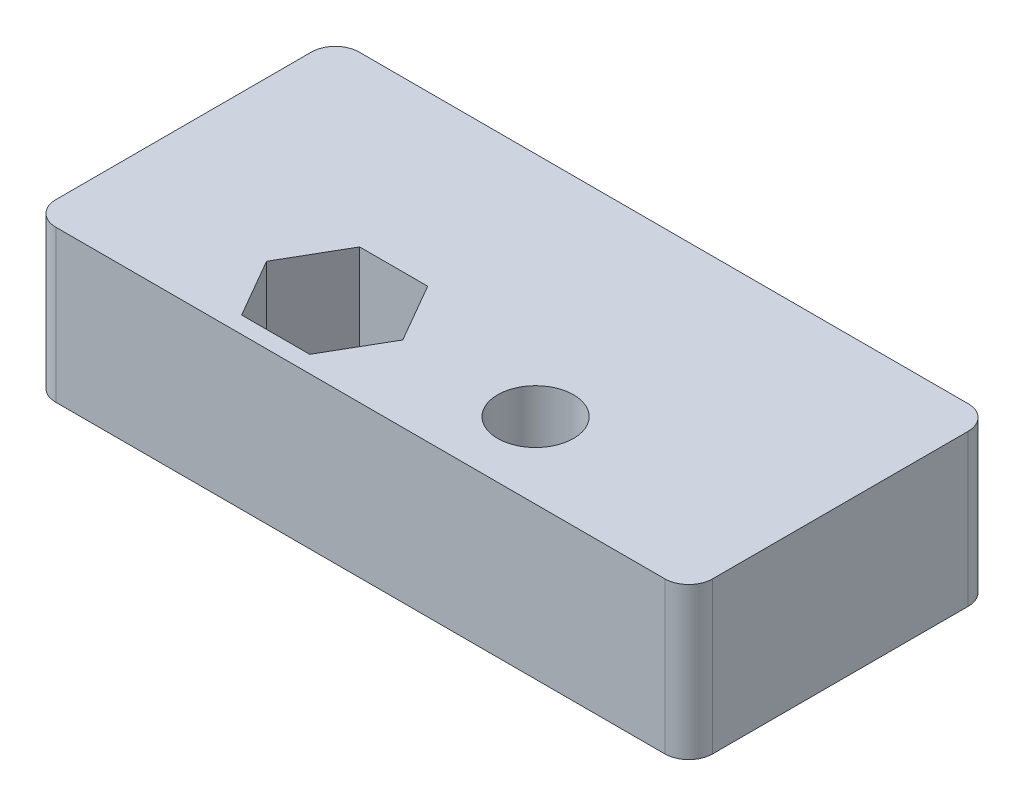
ISO-10303-21;
HEADER;
FILE_DESCRIPTION(('STEP AP214'),'2;1');
FILE_NAME('part.step','',(''),(''),'','','');
FILE_SCHEMA(('AUTOMOTIVE_DESIGN { 1 0 10303 214 1 1 1 1 }'));
ENDSEC;
DATA;
#1=APPLICATION_CONTEXT('core data for automotive mechanical design processes');
#2=APPLICATION_PROTOCOL_DEFINITION('international standard','automotive_design',2000,#1);
#3=PRODUCT_CONTEXT('',#1,'mechanical');
#4=PRODUCT('Part','Part','',(#3));
#5=PRODUCT_RELATED_PRODUCT_CATEGORY('part','',(#4));
#6=PRODUCT_DEFINITION_FORMATION('','',#4);
#7=PRODUCT_DEFINITION_CONTEXT('part definition',#1,'design');
#8=PRODUCT_DEFINITION('design','',#6,#7);
#9=PRODUCT_DEFINITION_SHAPE('','',#8);
#10=(LENGTH_UNIT() NAMED_UNIT(*) SI_UNIT(.MILLI.,.METRE.));
#11=(NAMED_UNIT(*) PLANE_ANGLE_UNIT() SI_UNIT($,.RADIAN.));
#12=(NAMED_UNIT(*) SI_UNIT($,.STERADIAN.) SOLID_ANGLE_UNIT());
#13=UNCERTAINTY_MEASURE_WITH_UNIT(LENGTH_MEASURE(1.E-05),#10,'distance_accuracy_value','');
#14=(GEOMETRIC_REPRESENTATION_CONTEXT(3) GLOBAL_UNCERTAINTY_ASSIGNED_CONTEXT((#13)) GLOBAL_UNIT_ASSIGNED_CONTEXT((#10,
#11,#12)) REPRESENTATION_CONTEXT('',''));
#15=CARTESIAN_POINT('',(0.,0.,0.));
#16=DIRECTION('',(0.,0.,1.));
#17=DIRECTION('',(1.,0.,0.));
#18=AXIS2_PLACEMENT_3D('',#15,#16,#17);
#19=CARTESIAN_POINT('',(0.,6.35,0.));
#20=DIRECTION('',(0.,-1.,0.));
#21=DIRECTION('',(0.,0.,-1.));
#22=AXIS2_PLACEMENT_3D('',#19,#20,#21);
#23=PLANE('',#22);
#24=CARTESIAN_POINT('',(17.9125,6.35,-3.175));
#25=DIRECTION('',(0.,1.,0.));
#26=DIRECTION('',(0.,0.,1.));
#27=AXIS2_PLACEMENT_3D('',#24,#25,#26);
#28=CIRCLE('',#27,1.5875);
#29=CARTESIAN_POINT('',(17.9125,6.35,-1.5875));
#30=VERTEX_POINT('',#29);
#31=EDGE_CURVE('E191',#30,#30,#28,.T.);
#32=ORIENTED_EDGE('',*,*,#31,.F.);
#33=EDGE_LOOP('',(#32));
#34=FACE_BOUND('',#33,.T.);
#35=DIRECTION('',(0.,0.,1.));
#36=VECTOR('',#35,1.);
#37=CARTESIAN_POINT('',(0.,6.35,0.));
#38=LINE('',#37,#36);
#39=CARTESIAN_POINT('',(0.,6.35,-11.7));
#40=VERTEX_POINT('',#39);
#41=CARTESIAN_POINT('',(0.,6.35,-1.));
#42=VERTEX_POINT('',#41);
#43=EDGE_CURVE('E197',#40,#42,#38,.T.);
#44=ORIENTED_EDGE('',*,*,#43,.T.);
#45=CARTESIAN_POINT('',(1.,6.35,-1.));
#46=DIRECTION('',(0.,-1.,0.));
#47=DIRECTION('',(0.,0.,-1.));
#48=AXIS2_PLACEMENT_3D('',#45,#46,#47);
#49=CIRCLE('',#48,1.);
#50=CARTESIAN_POINT('',(1.,6.35,0.));
#51=VERTEX_POINT('',#50);
#52=EDGE_CURVE('E240',#42,#51,#49,.F.);
#53=ORIENTED_EDGE('',*,*,#52,.T.);
#54=DIRECTION('',(1.,0.,0.));
#55=VECTOR('',#54,1.);
#56=CARTESIAN_POINT('',(0.,6.35,0.));
#57=LINE('',#56,#55);
#58=CARTESIAN_POINT('',(26.5,6.35,0.));
#59=VERTEX_POINT('',#58);
#60=EDGE_CURVE('E200',#51,#59,#57,.T.);
#61=ORIENTED_EDGE('',*,*,#60,.T.);
#62=CARTESIAN_POINT('',(26.5,6.35,-1.));
#63=DIRECTION('',(0.,-1.,0.));
#64=DIRECTION('',(0.,0.,-1.));
#65=AXIS2_PLACEMENT_3D('',#62,#63,#64);
#66=CIRCLE('',#65,1.);
#67=CARTESIAN_POINT('',(27.5,6.35,-1.));
#68=VERTEX_POINT('',#67);
#69=EDGE_CURVE('E235',#59,#68,#66,.F.);
#70=ORIENTED_EDGE('',*,*,#69,.T.);
#71=DIRECTION('',(0.,0.,-1.));
#72=VECTOR('',#71,1.);
#73=CARTESIAN_POINT('',(27.5,6.35,0.));
#74=LINE('',#73,#72);
#75=CARTESIAN_POINT('',(27.5,6.35,-11.7));
#76=VERTEX_POINT('',#75);
#77=EDGE_CURVE('E204',#68,#76,#74,.T.);
#78=ORIENTED_EDGE('',*,*,#77,.T.);
#79=CARTESIAN_POINT('',(26.5,6.35,-11.7));
#80=DIRECTION('',(0.,-1.,0.));
#81=DIRECTION('',(0.,0.,-1.));
#82=AXIS2_PLACEMENT_3D('',#79,#80,#81);
#83=CIRCLE('',#82,1.);
#84=CARTESIAN_POINT('',(26.5,6.35,-12.7));
#85=VERTEX_POINT('',#84);
#86=EDGE_CURVE('E54',#76,#85,#83,.F.);
#87=ORIENTED_EDGE('',*,*,#86,.T.);
#88=DIRECTION('',(-1.,0.,0.));
#89=VECTOR('',#88,1.);
#90=CARTESIAN_POINT('',(0.,6.35,-12.7));
#91=LINE('',#90,#89);
#92=CARTESIAN_POINT('',(1.,6.35,-12.7));
#93=VERTEX_POINT('',#92);
#94=EDGE_CURVE('E206',#85,#93,#91,.T.);
#95=ORIENTED_EDGE('',*,*,#94,.T.);
#96=CARTESIAN_POINT('',(1.,6.35,-11.7));
#97=DIRECTION('',(0.,-1.,0.));
#98=DIRECTION('',(0.,0.,-1.));
#99=AXIS2_PLACEMENT_3D('',#96,#97,#98);
#100=CIRCLE('',#99,1.);
#101=EDGE_CURVE('E238',#93,#40,#100,.F.);
#102=ORIENTED_EDGE('',*,*,#101,.T.);
#103=EDGE_LOOP('',(#44,#53,#61,#70,#78,#87,#95,#102));
#104=FACE_BOUND('',#103,.T.);
#105=DIRECTION('',(0.5,0.,-0.866025403784439));
#106=VECTOR('',#105,1.);
#107=CARTESIAN_POINT('',(10.9261417674388,6.35,-0.704849999999999));
#108=LINE('',#107,#106);
#109=CARTESIAN_POINT('',(10.9261417674388,6.35,-0.704849999999999));
#110=VERTEX_POINT('',#109);
#111=CARTESIAN_POINT('',(12.3522835348775,6.35,-3.175));
#112=VERTEX_POINT('',#111);
#113=EDGE_CURVE('E135',#110,#112,#108,.T.);
#114=ORIENTED_EDGE('',*,*,#113,.F.);
#115=DIRECTION('',(1.,0.,0.));
#116=VECTOR('',#115,1.);
#117=CARTESIAN_POINT('',(8.07385823256124,6.35,-0.70485));
#118=LINE('',#117,#116);
#119=CARTESIAN_POINT('',(8.07385823256124,6.35,-0.70485));
#120=VERTEX_POINT('',#119);
#121=EDGE_CURVE('E167',#120,#110,#118,.T.);
#122=ORIENTED_EDGE('',*,*,#121,.F.);
#123=DIRECTION('',(0.5,0.,0.866025403784439));
#124=VECTOR('',#123,1.);
#125=CARTESIAN_POINT('',(6.64771646512249,6.35,-3.175));
#126=LINE('',#125,#124);
#127=CARTESIAN_POINT('',(6.64771646512249,6.35,-3.175));
#128=VERTEX_POINT('',#127);
#129=EDGE_CURVE('E164',#128,#120,#126,.T.);
#130=ORIENTED_EDGE('',*,*,#129,.F.);
#131=DIRECTION('',(-0.5,0.,0.866025403784439));
#132=VECTOR('',#131,1.);
#133=CARTESIAN_POINT('',(8.07385823256125,6.35,-5.64515));
#134=LINE('',#133,#132);
#135=CARTESIAN_POINT('',(8.07385823256125,6.35,-5.64515));
#136=VERTEX_POINT('',#135);
#137=EDGE_CURVE('E160',#136,#128,#134,.T.);
#138=ORIENTED_EDGE('',*,*,#137,.F.);
#139=DIRECTION('',(-1.,0.,0.));
#140=VECTOR('',#139,1.);
#141=CARTESIAN_POINT('',(10.9261417674388,6.35,-5.64515));
#142=LINE('',#141,#140);
#143=CARTESIAN_POINT('',(10.9261417674388,6.35,-5.64515));
#144=VERTEX_POINT('',#143);
#145=EDGE_CURVE('E158',#144,#136,#142,.T.);
#146=ORIENTED_EDGE('',*,*,#145,.F.);
#147=DIRECTION('',(-0.5,0.,-0.866025403784439));
#148=VECTOR('',#147,1.);
#149=CARTESIAN_POINT('',(12.3522835348775,6.35,-3.175));
#150=LINE('',#149,#148);
#151=EDGE_CURVE('E145',#112,#144,#150,.T.);
#152=ORIENTED_EDGE('',*,*,#151,.F.);
#153=EDGE_LOOP('',(#114,#122,#130,#138,#146,#152));
#154=FACE_BOUND('',#153,.T.);
#155=ADVANCED_FACE('F32',(#34,#104,#154),#23,.F.);
#156=CARTESIAN_POINT('',(0.,0.,0.));
#157=DIRECTION('',(0.,-1.,0.));
#158=DIRECTION('',(0.,0.,-1.));
#159=AXIS2_PLACEMENT_3D('',#156,#157,#158);
#160=PLANE('',#159);
#161=DIRECTION('',(1.,0.,0.));
#162=VECTOR('',#161,1.);
#163=CARTESIAN_POINT('',(0.,0.,0.));
#164=LINE('',#163,#162);
#165=CARTESIAN_POINT('',(1.,0.,0.));
#166=VERTEX_POINT('',#165);
#167=CARTESIAN_POINT('',(26.5,0.,0.));
#168=VERTEX_POINT('',#167);
#169=EDGE_CURVE('E211',#166,#168,#164,.T.);
#170=ORIENTED_EDGE('',*,*,#169,.F.);
#171=CARTESIAN_POINT('',(1.,0.,-1.));
#172=DIRECTION('',(0.,-1.,0.));
#173=DIRECTION('',(0.,0.,-1.));
#174=AXIS2_PLACEMENT_3D('',#171,#172,#173);
#175=CIRCLE('',#174,1.);
#176=CARTESIAN_POINT('',(0.,0.,-1.));
#177=VERTEX_POINT('',#176);
#178=EDGE_CURVE('E228',#166,#177,#175,.T.);
#179=ORIENTED_EDGE('',*,*,#178,.T.);
#180=DIRECTION('',(0.,0.,1.));
#181=VECTOR('',#180,1.);
#182=CARTESIAN_POINT('',(0.,0.,0.));
#183=LINE('',#182,#181);
#184=CARTESIAN_POINT('',(0.,0.,-11.7));
#185=VERTEX_POINT('',#184);
#186=EDGE_CURVE('E194',#185,#177,#183,.T.);
#187=ORIENTED_EDGE('',*,*,#186,.F.);
#188=CARTESIAN_POINT('',(1.,0.,-11.7));
#189=DIRECTION('',(0.,-1.,0.));
#190=DIRECTION('',(0.,0.,-1.));
#191=AXIS2_PLACEMENT_3D('',#188,#189,#190);
#192=CIRCLE('',#191,1.);
#193=CARTESIAN_POINT('',(1.,0.,-12.7));
#194=VERTEX_POINT('',#193);
#195=EDGE_CURVE('E226',#185,#194,#192,.T.);
#196=ORIENTED_EDGE('',*,*,#195,.T.);
#197=DIRECTION('',(-1.,0.,0.));
#198=VECTOR('',#197,1.);
#199=CARTESIAN_POINT('',(0.,0.,-12.7));
#200=LINE('',#199,#198);
#201=CARTESIAN_POINT('',(26.5,0.,-12.7));
#202=VERTEX_POINT('',#201);
#203=EDGE_CURVE('E201',#202,#194,#200,.T.);
#204=ORIENTED_EDGE('',*,*,#203,.F.);
#205=CARTESIAN_POINT('',(26.5,0.,-11.7));
#206=DIRECTION('',(0.,-1.,0.));
#207=DIRECTION('',(0.,0.,-1.));
#208=AXIS2_PLACEMENT_3D('',#205,#206,#207);
#209=CIRCLE('',#208,1.);
#210=CARTESIAN_POINT('',(27.5,0.,-11.7));
#211=VERTEX_POINT('',#210);
#212=EDGE_CURVE('E224',#202,#211,#209,.T.);
#213=ORIENTED_EDGE('',*,*,#212,.T.);
#214=DIRECTION('',(0.,0.,-1.));
#215=VECTOR('',#214,1.);
#216=CARTESIAN_POINT('',(27.5,0.,0.));
#217=LINE('',#216,#215);
#218=CARTESIAN_POINT('',(27.5,0.,-1.));
#219=VERTEX_POINT('',#218);
#220=EDGE_CURVE('E214',#219,#211,#217,.T.);
#221=ORIENTED_EDGE('',*,*,#220,.F.);
#222=CARTESIAN_POINT('',(26.5,0.,-1.));
#223=DIRECTION('',(0.,-1.,0.));
#224=DIRECTION('',(0.,0.,-1.));
#225=AXIS2_PLACEMENT_3D('',#222,#223,#224);
#226=CIRCLE('',#225,1.);
#227=EDGE_CURVE('E222',#219,#168,#226,.T.);
#228=ORIENTED_EDGE('',*,*,#227,.T.);
#229=EDGE_LOOP('',(#170,#179,#187,#196,#204,#213,#221,#228));
#230=FACE_BOUND('',#229,.T.);
#231=CARTESIAN_POINT('',(17.9125,0.,-3.175));
#232=DIRECTION('',(0.,1.,0.));
#233=DIRECTION('',(0.,0.,1.));
#234=AXIS2_PLACEMENT_3D('',#231,#232,#233);
#235=CIRCLE('',#234,1.5875);
#236=CARTESIAN_POINT('',(17.9125,0.,-1.5875));
#237=VERTEX_POINT('',#236);
#238=EDGE_CURVE('E153',#237,#237,#235,.T.);
#239=ORIENTED_EDGE('',*,*,#238,.T.);
#240=EDGE_LOOP('',(#239));
#241=FACE_BOUND('',#240,.T.);
#242=DIRECTION('',(1.,0.,0.));
#243=VECTOR('',#242,1.);
#244=CARTESIAN_POINT('',(8.07385823256124,0.,-0.70485));
#245=LINE('',#244,#243);
#246=CARTESIAN_POINT('',(8.07385823256124,0.,-0.70485));
#247=VERTEX_POINT('',#246);
#248=CARTESIAN_POINT('',(10.9261417674388,0.,-0.704849999999999));
#249=VERTEX_POINT('',#248);
#250=EDGE_CURVE('E146',#247,#249,#245,.T.);
#251=ORIENTED_EDGE('',*,*,#250,.T.);
#252=DIRECTION('',(0.5,0.,-0.866025403784439));
#253=VECTOR('',#252,1.);
#254=CARTESIAN_POINT('',(10.9261417674388,0.,-0.704849999999999));
#255=LINE('',#254,#253);
#256=CARTESIAN_POINT('',(12.3522835348775,0.,-3.175));
#257=VERTEX_POINT('',#256);
#258=EDGE_CURVE('E169',#249,#257,#255,.T.);
#259=ORIENTED_EDGE('',*,*,#258,.T.);
#260=DIRECTION('',(-0.5,0.,-0.866025403784439));
#261=VECTOR('',#260,1.);
#262=CARTESIAN_POINT('',(12.3522835348775,0.,-3.175));
#263=LINE('',#262,#261);
#264=CARTESIAN_POINT('',(10.9261417674388,0.,-5.64515));
#265=VERTEX_POINT('',#264);
#266=EDGE_CURVE('E152',#257,#265,#263,.T.);
#267=ORIENTED_EDGE('',*,*,#266,.T.);
#268=DIRECTION('',(-1.,0.,0.));
#269=VECTOR('',#268,1.);
#270=CARTESIAN_POINT('',(10.9261417674388,0.,-5.64515));
#271=LINE('',#270,#269);
#272=CARTESIAN_POINT('',(8.07385823256125,0.,-5.64515));
#273=VERTEX_POINT('',#272);
#274=EDGE_CURVE('E172',#265,#273,#271,.T.);
#275=ORIENTED_EDGE('',*,*,#274,.T.);
#276=DIRECTION('',(-0.5,0.,0.866025403784439));
#277=VECTOR('',#276,1.);
#278=CARTESIAN_POINT('',(8.07385823256125,0.,-5.64515));
#279=LINE('',#278,#277);
#280=CARTESIAN_POINT('',(6.64771646512249,0.,-3.175));
#281=VERTEX_POINT('',#280);
#282=EDGE_CURVE('E175',#273,#281,#279,.T.);
#283=ORIENTED_EDGE('',*,*,#282,.T.);
#284=DIRECTION('',(0.5,0.,0.866025403784439));
#285=VECTOR('',#284,1.);
#286=CARTESIAN_POINT('',(6.64771646512249,0.,-3.175));
#287=LINE('',#286,#285);
#288=EDGE_CURVE('E178',#281,#247,#287,.T.);
#289=ORIENTED_EDGE('',*,*,#288,.T.);
#290=EDGE_LOOP('',(#251,#259,#267,#275,#283,#289));
#291=FACE_BOUND('',#290,.T.);
#292=ADVANCED_FACE('F256',(#230,#241,#291),#160,.T.);
#293=CARTESIAN_POINT('',(0.,6.35,0.));
#294=DIRECTION('',(1.,0.,0.));
#295=DIRECTION('',(0.,0.,-1.));
#296=AXIS2_PLACEMENT_3D('',#293,#294,#295);
#297=PLANE('',#296);
#298=ORIENTED_EDGE('',*,*,#186,.T.);
#299=DIRECTION('',(0.,-1.,0.));
#300=VECTOR('',#299,1.);
#301=CARTESIAN_POINT('',(0.,6.35,-1.));
#302=LINE('',#301,#300);
#303=EDGE_CURVE('E233',#177,#42,#302,.F.);
#304=ORIENTED_EDGE('',*,*,#303,.T.);
#305=ORIENTED_EDGE('',*,*,#43,.F.);
#306=DIRECTION('',(0.,-1.,0.));
#307=VECTOR('',#306,1.);
#308=CARTESIAN_POINT('',(0.,6.35,-11.7));
#309=LINE('',#308,#307);
#310=EDGE_CURVE('E230',#40,#185,#309,.T.);
#311=ORIENTED_EDGE('',*,*,#310,.T.);
#312=EDGE_LOOP('',(#298,#304,#305,#311));
#313=FACE_BOUND('',#312,.T.);
#314=ADVANCED_FACE('F270',(#313),#297,.F.);
#315=CARTESIAN_POINT('',(0.,6.35,0.));
#316=DIRECTION('',(0.,0.,-1.));
#317=DIRECTION('',(-1.,0.,0.));
#318=AXIS2_PLACEMENT_3D('',#315,#316,#317);
#319=PLANE('',#318);
#320=ORIENTED_EDGE('',*,*,#60,.F.);
#321=DIRECTION('',(0.,-1.,0.));
#322=VECTOR('',#321,1.);
#323=CARTESIAN_POINT('',(1.,6.35,0.));
#324=LINE('',#323,#322);
#325=EDGE_CURVE('E219',#51,#166,#324,.T.);
#326=ORIENTED_EDGE('',*,*,#325,.T.);
#327=ORIENTED_EDGE('',*,*,#169,.T.);
#328=DIRECTION('',(0.,-1.,0.));
#329=VECTOR('',#328,1.);
#330=CARTESIAN_POINT('',(26.5,6.35,0.));
#331=LINE('',#330,#329);
#332=EDGE_CURVE('E208',#168,#59,#331,.F.);
#333=ORIENTED_EDGE('',*,*,#332,.T.);
#334=EDGE_LOOP('',(#320,#326,#327,#333));
#335=FACE_BOUND('',#334,.T.);
#336=ADVANCED_FACE('F278',(#335),#319,.F.);
#337=CARTESIAN_POINT('',(27.5,6.35,0.));
#338=DIRECTION('',(-1.,0.,0.));
#339=DIRECTION('',(0.,0.,1.));
#340=AXIS2_PLACEMENT_3D('',#337,#338,#339);
#341=PLANE('',#340);
#342=ORIENTED_EDGE('',*,*,#220,.T.);
#343=DIRECTION('',(0.,-1.,0.));
#344=VECTOR('',#343,1.);
#345=CARTESIAN_POINT('',(27.5,6.35,-11.7));
#346=LINE('',#345,#344);
#347=EDGE_CURVE('E11',#211,#76,#346,.F.);
#348=ORIENTED_EDGE('',*,*,#347,.T.);
#349=ORIENTED_EDGE('',*,*,#77,.F.);
#350=DIRECTION('',(0.,-1.,0.));
#351=VECTOR('',#350,1.);
#352=CARTESIAN_POINT('',(27.5,6.35,-1.));
#353=LINE('',#352,#351);
#354=EDGE_CURVE('E40',#68,#219,#353,.T.);
#355=ORIENTED_EDGE('',*,*,#354,.T.);
#356=EDGE_LOOP('',(#342,#348,#349,#355));
#357=FACE_BOUND('',#356,.T.);
#358=ADVANCED_FACE('F250',(#357),#341,.F.);
#359=CARTESIAN_POINT('',(0.,6.35,-12.7));
#360=DIRECTION('',(0.,0.,1.));
#361=DIRECTION('',(1.,0.,0.));
#362=AXIS2_PLACEMENT_3D('',#359,#360,#361);
#363=PLANE('',#362);
#364=ORIENTED_EDGE('',*,*,#203,.T.);
#365=DIRECTION('',(0.,-1.,0.));
#366=VECTOR('',#365,1.);
#367=CARTESIAN_POINT('',(1.,6.35,-12.7));
#368=LINE('',#367,#366);
#369=EDGE_CURVE('E47',#194,#93,#368,.F.);
#370=ORIENTED_EDGE('',*,*,#369,.T.);
#371=ORIENTED_EDGE('',*,*,#94,.F.);
#372=DIRECTION('',(0.,-1.,0.));
#373=VECTOR('',#372,1.);
#374=CARTESIAN_POINT('',(26.5,6.35,-12.7));
#375=LINE('',#374,#373);
#376=EDGE_CURVE('E242',#85,#202,#375,.T.);
#377=ORIENTED_EDGE('',*,*,#376,.T.);
#378=EDGE_LOOP('',(#364,#370,#371,#377));
#379=FACE_BOUND('',#378,.T.);
#380=ADVANCED_FACE('F262',(#379),#363,.F.);
#381=CARTESIAN_POINT('',(17.9125,6.35,-3.175));
#382=DIRECTION('',(0.,-1.,0.));
#383=DIRECTION('',(0.,0.,-1.));
#384=AXIS2_PLACEMENT_3D('',#381,#382,#383);
#385=CYLINDRICAL_SURFACE('',#384,1.5875);
#386=ORIENTED_EDGE('',*,*,#31,.T.);
#387=EDGE_LOOP('',(#386));
#388=FACE_BOUND('',#387,.T.);
#389=ORIENTED_EDGE('',*,*,#238,.F.);
#390=EDGE_LOOP('',(#389));
#391=FACE_BOUND('',#390,.T.);
#392=ADVANCED_FACE('F293',(#388,#391),#385,.F.);
#393=CARTESIAN_POINT('',(10.9261417674388,6.35,-0.704849999999999));
#394=DIRECTION('',(-0.866025403784438,0.,-0.5));
#395=DIRECTION('',(-0.5,0.,0.866025403784439));
#396=AXIS2_PLACEMENT_3D('',#393,#394,#395);
#397=PLANE('',#396);
#398=ORIENTED_EDGE('',*,*,#258,.F.);
#399=DIRECTION('',(0.,-1.,0.));
#400=VECTOR('',#399,1.);
#401=CARTESIAN_POINT('',(10.9261417674388,6.35,-0.704849999999999));
#402=LINE('',#401,#400);
#403=EDGE_CURVE('E141',#110,#249,#402,.T.);
#404=ORIENTED_EDGE('',*,*,#403,.F.);
#405=ORIENTED_EDGE('',*,*,#113,.T.);
#406=DIRECTION('',(0.,-1.,0.));
#407=VECTOR('',#406,1.);
#408=CARTESIAN_POINT('',(12.3522835348775,6.35,-3.175));
#409=LINE('',#408,#407);
#410=EDGE_CURVE('E138',#112,#257,#409,.T.);
#411=ORIENTED_EDGE('',*,*,#410,.T.);
#412=EDGE_LOOP('',(#398,#404,#405,#411));
#413=FACE_BOUND('',#412,.T.);
#414=ADVANCED_FACE('F137',(#413),#397,.T.);
#415=CARTESIAN_POINT('',(12.3522835348775,6.35,-3.175));
#416=DIRECTION('',(-0.866025403784439,0.,0.5));
#417=DIRECTION('',(0.5,0.,0.866025403784439));
#418=AXIS2_PLACEMENT_3D('',#415,#416,#417);
#419=PLANE('',#418);
#420=ORIENTED_EDGE('',*,*,#266,.F.);
#421=ORIENTED_EDGE('',*,*,#410,.F.);
#422=ORIENTED_EDGE('',*,*,#151,.T.);
#423=DIRECTION('',(0.,-1.,0.));
#424=VECTOR('',#423,1.);
#425=CARTESIAN_POINT('',(10.9261417674388,6.35,-5.64515));
#426=LINE('',#425,#424);
#427=EDGE_CURVE('E154',#144,#265,#426,.T.);
#428=ORIENTED_EDGE('',*,*,#427,.T.);
#429=EDGE_LOOP('',(#420,#421,#422,#428));
#430=FACE_BOUND('',#429,.T.);
#431=ADVANCED_FACE('F149',(#430),#419,.T.);
#432=CARTESIAN_POINT('',(10.9261417674388,6.35,-5.64515));
#433=DIRECTION('',(0.,0.,1.));
#434=DIRECTION('',(1.,0.,0.));
#435=AXIS2_PLACEMENT_3D('',#432,#433,#434);
#436=PLANE('',#435);
#437=ORIENTED_EDGE('',*,*,#274,.F.);
#438=ORIENTED_EDGE('',*,*,#427,.F.);
#439=ORIENTED_EDGE('',*,*,#145,.T.);
#440=DIRECTION('',(0.,-1.,0.));
#441=VECTOR('',#440,1.);
#442=CARTESIAN_POINT('',(8.07385823256125,6.35,-5.64515));
#443=LINE('',#442,#441);
#444=EDGE_CURVE('E188',#136,#273,#443,.T.);
#445=ORIENTED_EDGE('',*,*,#444,.T.);
#446=EDGE_LOOP('',(#437,#438,#439,#445));
#447=FACE_BOUND('',#446,.T.);
#448=ADVANCED_FACE('F355',(#447),#436,.T.);
#449=CARTESIAN_POINT('',(8.07385823256125,6.35,-5.64515));
#450=DIRECTION('',(0.866025403784439,0.,0.5));
#451=DIRECTION('',(0.5,0.,-0.866025403784439));
#452=AXIS2_PLACEMENT_3D('',#449,#450,#451);
#453=PLANE('',#452);
#454=ORIENTED_EDGE('',*,*,#282,.F.);
#455=ORIENTED_EDGE('',*,*,#444,.F.);
#456=ORIENTED_EDGE('',*,*,#137,.T.);
#457=DIRECTION('',(0.,-1.,0.));
#458=VECTOR('',#457,1.);
#459=CARTESIAN_POINT('',(6.64771646512249,6.35,-3.175));
#460=LINE('',#459,#458);
#461=EDGE_CURVE('E186',#128,#281,#460,.T.);
#462=ORIENTED_EDGE('',*,*,#461,.T.);
#463=EDGE_LOOP('',(#454,#455,#456,#462));
#464=FACE_BOUND('',#463,.T.);
#465=ADVANCED_FACE('F346',(#464),#453,.T.);
#466=CARTESIAN_POINT('',(6.64771646512249,6.35,-3.175));
#467=DIRECTION('',(0.866025403784439,0.,-0.5));
#468=DIRECTION('',(-0.5,0.,-0.866025403784439));
#469=AXIS2_PLACEMENT_3D('',#466,#467,#468);
#470=PLANE('',#469);
#471=ORIENTED_EDGE('',*,*,#288,.F.);
#472=ORIENTED_EDGE('',*,*,#461,.F.);
#473=ORIENTED_EDGE('',*,*,#129,.T.);
#474=DIRECTION('',(0.,-1.,0.));
#475=VECTOR('',#474,1.);
#476=CARTESIAN_POINT('',(8.07385823256124,6.35,-0.70485));
#477=LINE('',#476,#475);
#478=EDGE_CURVE('E184',#120,#247,#477,.T.);
#479=ORIENTED_EDGE('',*,*,#478,.T.);
#480=EDGE_LOOP('',(#471,#472,#473,#479));
#481=FACE_BOUND('',#480,.T.);
#482=ADVANCED_FACE('F337',(#481),#470,.T.);
#483=CARTESIAN_POINT('',(8.07385823256124,6.35,-0.70485));
#484=DIRECTION('',(0.,0.,-1.));
#485=DIRECTION('',(-1.,0.,0.));
#486=AXIS2_PLACEMENT_3D('',#483,#484,#485);
#487=PLANE('',#486);
#488=ORIENTED_EDGE('',*,*,#250,.F.);
#489=ORIENTED_EDGE('',*,*,#478,.F.);
#490=ORIENTED_EDGE('',*,*,#121,.T.);
#491=ORIENTED_EDGE('',*,*,#403,.T.);
#492=EDGE_LOOP('',(#488,#489,#490,#491));
#493=FACE_BOUND('',#492,.T.);
#494=ADVANCED_FACE('F306',(#493),#487,.T.);
#495=CARTESIAN_POINT('',(1.,6.35,-1.));
#496=DIRECTION('',(0.,-1.,0.));
#497=DIRECTION('',(0.,0.,-1.));
#498=AXIS2_PLACEMENT_3D('',#495,#496,#497);
#499=CYLINDRICAL_SURFACE('',#498,1.);
#500=ORIENTED_EDGE('',*,*,#52,.F.);
#501=ORIENTED_EDGE('',*,*,#303,.F.);
#502=ORIENTED_EDGE('',*,*,#178,.F.);
#503=ORIENTED_EDGE('',*,*,#325,.F.);
#504=EDGE_LOOP('',(#500,#501,#502,#503));
#505=FACE_BOUND('',#504,.T.);
#506=ADVANCED_FACE('F275',(#505),#499,.T.);
#507=CARTESIAN_POINT('',(1.,6.35,-11.7));
#508=DIRECTION('',(0.,-1.,0.));
#509=DIRECTION('',(0.,0.,-1.));
#510=AXIS2_PLACEMENT_3D('',#507,#508,#509);
#511=CYLINDRICAL_SURFACE('',#510,1.);
#512=ORIENTED_EDGE('',*,*,#101,.F.);
#513=ORIENTED_EDGE('',*,*,#369,.F.);
#514=ORIENTED_EDGE('',*,*,#195,.F.);
#515=ORIENTED_EDGE('',*,*,#310,.F.);
#516=EDGE_LOOP('',(#512,#513,#514,#515));
#517=FACE_BOUND('',#516,.T.);
#518=ADVANCED_FACE('F267',(#517),#511,.T.);
#519=CARTESIAN_POINT('',(26.5,6.35,-11.7));
#520=DIRECTION('',(0.,-1.,0.));
#521=DIRECTION('',(0.,0.,-1.));
#522=AXIS2_PLACEMENT_3D('',#519,#520,#521);
#523=CYLINDRICAL_SURFACE('',#522,1.);
#524=ORIENTED_EDGE('',*,*,#86,.F.);
#525=ORIENTED_EDGE('',*,*,#347,.F.);
#526=ORIENTED_EDGE('',*,*,#212,.F.);
#527=ORIENTED_EDGE('',*,*,#376,.F.);
#528=EDGE_LOOP('',(#524,#525,#526,#527));
#529=FACE_BOUND('',#528,.T.);
#530=ADVANCED_FACE('F261',(#529),#523,.T.);
#531=CARTESIAN_POINT('',(26.5,6.35,-1.));
#532=DIRECTION('',(0.,-1.,0.));
#533=DIRECTION('',(0.,0.,-1.));
#534=AXIS2_PLACEMENT_3D('',#531,#532,#533);
#535=CYLINDRICAL_SURFACE('',#534,1.);
#536=ORIENTED_EDGE('',*,*,#69,.F.);
#537=ORIENTED_EDGE('',*,*,#332,.F.);
#538=ORIENTED_EDGE('',*,*,#227,.F.);
#539=ORIENTED_EDGE('',*,*,#354,.F.);
#540=EDGE_LOOP('',(#536,#537,#538,#539));
#541=FACE_BOUND('',#540,.T.);
#542=ADVANCED_FACE('F34',(#541),#535,.T.);
#543=CLOSED_SHELL('',(#155,#292,#314,#336,#358,#380,#392,#414,#431,#448,#465,#482,#494,#506,
#518,#530,#542));
#544=MANIFOLD_SOLID_BREP('B2',#543);
#545=ADVANCED_BREP_SHAPE_REPRESENTATION('',(#18,#544),#14);
#546=SHAPE_DEFINITION_REPRESENTATION(#9,#545);
ENDSEC;
END-ISO-10303-21;
